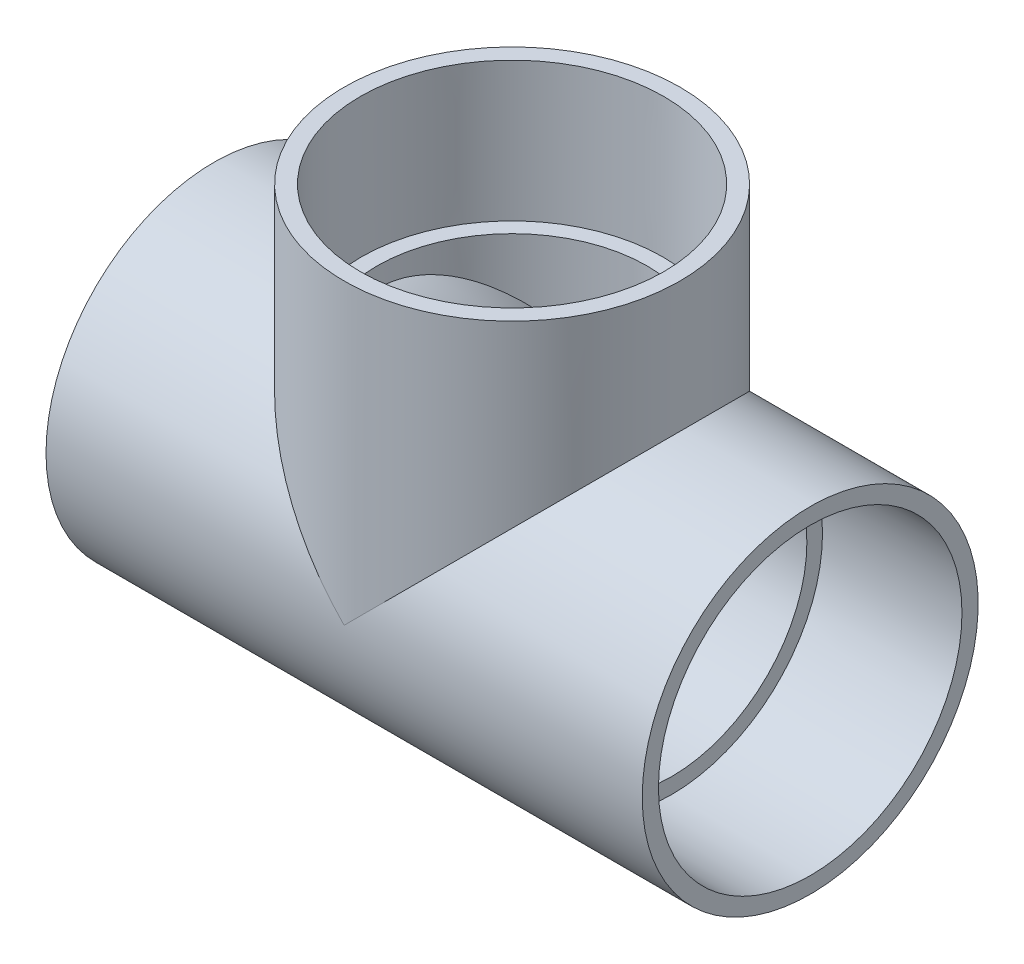
ISO-10303-21;
HEADER;
FILE_DESCRIPTION(('STEP AP214'),'2;1');
FILE_NAME('part.step','',(''),(''),'','','');
FILE_SCHEMA(('AUTOMOTIVE_DESIGN { 1 0 10303 214 1 1 1 1 }'));
ENDSEC;
DATA;
#1=APPLICATION_CONTEXT('core data for automotive mechanical design processes');
#2=APPLICATION_PROTOCOL_DEFINITION('international standard','automotive_design',2000,#1);
#3=PRODUCT_CONTEXT('',#1,'mechanical');
#4=PRODUCT('Part','Part','',(#3));
#5=PRODUCT_RELATED_PRODUCT_CATEGORY('part','',(#4));
#6=PRODUCT_DEFINITION_FORMATION('','',#4);
#7=PRODUCT_DEFINITION_CONTEXT('part definition',#1,'design');
#8=PRODUCT_DEFINITION('design','',#6,#7);
#9=PRODUCT_DEFINITION_SHAPE('','',#8);
#10=(LENGTH_UNIT() NAMED_UNIT(*) SI_UNIT(.MILLI.,.METRE.));
#11=(NAMED_UNIT(*) PLANE_ANGLE_UNIT() SI_UNIT($,.RADIAN.));
#12=(NAMED_UNIT(*) SI_UNIT($,.STERADIAN.) SOLID_ANGLE_UNIT());
#13=UNCERTAINTY_MEASURE_WITH_UNIT(LENGTH_MEASURE(1.E-05),#10,'distance_accuracy_value','');
#14=(GEOMETRIC_REPRESENTATION_CONTEXT(3) GLOBAL_UNCERTAINTY_ASSIGNED_CONTEXT((#13)) GLOBAL_UNIT_ASSIGNED_CONTEXT((#10,
#11,#12)) REPRESENTATION_CONTEXT('',''));
#15=CARTESIAN_POINT('',(0.,0.,0.));
#16=DIRECTION('',(0.,0.,1.));
#17=DIRECTION('',(1.,0.,0.));
#18=AXIS2_PLACEMENT_3D('',#15,#16,#17);
#19=CARTESIAN_POINT('',(-112.7125,0.,0.));
#20=DIRECTION('',(-1.,0.,0.));
#21=DIRECTION('',(0.,0.,1.));
#22=AXIS2_PLACEMENT_3D('',#19,#20,#21);
#23=CYLINDRICAL_SURFACE('',#22,63.5);
#24=CARTESIAN_POINT('',(-112.7125,0.,0.));
#25=DIRECTION('',(-1.,0.,0.));
#26=DIRECTION('',(0.,0.,1.));
#27=AXIS2_PLACEMENT_3D('',#24,#25,#26);
#28=CIRCLE('',#27,63.5);
#29=CARTESIAN_POINT('',(-112.7125,0.,63.5));
#30=VERTEX_POINT('',#29);
#31=EDGE_CURVE('E98',#30,#30,#28,.T.);
#32=ORIENTED_EDGE('',*,*,#31,.F.);
#33=EDGE_LOOP('',(#32));
#34=FACE_BOUND('',#33,.T.);
#35=CARTESIAN_POINT('',(112.7125,0.,0.));
#36=DIRECTION('',(-1.,0.,0.));
#37=DIRECTION('',(0.,0.,1.));
#38=AXIS2_PLACEMENT_3D('',#35,#36,#37);
#39=CIRCLE('',#38,63.5);
#40=CARTESIAN_POINT('',(112.7125,0.,63.5));
#41=VERTEX_POINT('',#40);
#42=EDGE_CURVE('E76',#41,#41,#39,.T.);
#43=ORIENTED_EDGE('',*,*,#42,.T.);
#44=EDGE_LOOP('',(#43));
#45=FACE_BOUND('',#44,.T.);
#46=CARTESIAN_POINT('',(0.,0.,0.));
#47=DIRECTION('',(-0.707106781186547,-0.707106781186547,0.));
#48=DIRECTION('',(-0.707106781186547,0.707106781186547,0.));
#49=AXIS2_PLACEMENT_3D('',#46,#47,#48);
#50=ELLIPSE('',#49,89.8025612106915,63.5);
#51=CARTESIAN_POINT('',(0.,0.,-63.5));
#52=VERTEX_POINT('',#51);
#53=CARTESIAN_POINT('',(0.,0.,63.5));
#54=VERTEX_POINT('',#53);
#55=EDGE_CURVE('E53',#52,#54,#50,.F.);
#56=ORIENTED_EDGE('',*,*,#55,.F.);
#57=CARTESIAN_POINT('',(0.,0.,0.));
#58=DIRECTION('',(0.707106781186547,-0.707106781186547,0.));
#59=DIRECTION('',(-0.707106781186547,-0.707106781186547,0.));
#60=AXIS2_PLACEMENT_3D('',#57,#58,#59);
#61=ELLIPSE('',#60,89.8025612106915,63.5);
#62=EDGE_CURVE('E89',#52,#54,#61,.T.);
#63=ORIENTED_EDGE('',*,*,#62,.T.);
#64=EDGE_LOOP('',(#56,#63));
#65=FACE_BOUND('',#64,.T.);
#66=ADVANCED_FACE('F34',(#34,#45,#65),#23,.T.);
#67=CARTESIAN_POINT('',(-112.7125,-63.5,0.));
#68=DIRECTION('',(-1.,0.,0.));
#69=DIRECTION('',(0.,0.,1.));
#70=AXIS2_PLACEMENT_3D('',#67,#68,#69);
#71=PLANE('',#70);
#72=ORIENTED_EDGE('',*,*,#31,.T.);
#73=EDGE_LOOP('',(#72));
#74=FACE_BOUND('',#73,.T.);
#75=CARTESIAN_POINT('',(-112.7125,0.,0.));
#76=DIRECTION('',(-1.,0.,0.));
#77=DIRECTION('',(0.,0.,1.));
#78=AXIS2_PLACEMENT_3D('',#75,#76,#77);
#79=CIRCLE('',#78,57.3786);
#80=CARTESIAN_POINT('',(-112.7125,0.,57.3786));
#81=VERTEX_POINT('',#80);
#82=EDGE_CURVE('E106',#81,#81,#79,.T.);
#83=ORIENTED_EDGE('',*,*,#82,.F.);
#84=EDGE_LOOP('',(#83));
#85=FACE_BOUND('',#84,.T.);
#86=ADVANCED_FACE('F36',(#74,#85),#71,.T.);
#87=CARTESIAN_POINT('',(-60.325,0.,0.));
#88=DIRECTION('',(-1.,0.,0.));
#89=DIRECTION('',(0.,0.,1.));
#90=AXIS2_PLACEMENT_3D('',#87,#88,#89);
#91=CONICAL_SURFACE('',#90,57.0357,0.00654536107227507);
#92=ORIENTED_EDGE('',*,*,#82,.T.);
#93=EDGE_LOOP('',(#92));
#94=FACE_BOUND('',#93,.T.);
#95=CARTESIAN_POINT('',(-60.325,0.,0.));
#96=DIRECTION('',(-1.,0.,0.));
#97=DIRECTION('',(0.,0.,1.));
#98=AXIS2_PLACEMENT_3D('',#95,#96,#97);
#99=CIRCLE('',#98,57.0357);
#100=CARTESIAN_POINT('',(-60.325,0.,57.0357));
#101=VERTEX_POINT('',#100);
#102=EDGE_CURVE('E103',#101,#101,#99,.T.);
#103=ORIENTED_EDGE('',*,*,#102,.F.);
#104=EDGE_LOOP('',(#103));
#105=FACE_BOUND('',#104,.T.);
#106=ADVANCED_FACE('F140',(#94,#105),#91,.F.);
#107=CARTESIAN_POINT('',(237.699267087985,60.325,-19.8278686449149));
#108=DIRECTION('',(0.,-1.,0.));
#109=DIRECTION('',(0.,0.,-1.));
#110=AXIS2_PLACEMENT_3D('',#107,#108,#109);
#111=PLANE('',#110);
#112=CARTESIAN_POINT('',(0.,60.325,0.));
#113=DIRECTION('',(0.,1.,0.));
#114=DIRECTION('',(0.,0.,1.));
#115=AXIS2_PLACEMENT_3D('',#112,#113,#114);
#116=CIRCLE('',#115,51.1302);
#117=CARTESIAN_POINT('',(0.,60.325,51.1302));
#118=VERTEX_POINT('',#117);
#119=EDGE_CURVE('E74',#118,#118,#116,.T.);
#120=ORIENTED_EDGE('',*,*,#119,.F.);
#121=EDGE_LOOP('',(#120));
#122=FACE_BOUND('',#121,.T.);
#123=CARTESIAN_POINT('',(0.,60.325,0.));
#124=DIRECTION('',(0.,-1.,0.));
#125=DIRECTION('',(0.,0.,-1.));
#126=AXIS2_PLACEMENT_3D('',#123,#124,#125);
#127=CIRCLE('',#126,57.0357);
#128=CARTESIAN_POINT('',(0.,60.325,-57.0357));
#129=VERTEX_POINT('',#128);
#130=EDGE_CURVE('E60',#129,#129,#127,.F.);
#131=ORIENTED_EDGE('',*,*,#130,.T.);
#132=EDGE_LOOP('',(#131));
#133=FACE_BOUND('',#132,.T.);
#134=ADVANCED_FACE('F112',(#122,#133),#111,.F.);
#135=CARTESIAN_POINT('',(-60.325,0.,0.));
#136=DIRECTION('',(1.,0.,0.));
#137=DIRECTION('',(0.,0.,-1.));
#138=AXIS2_PLACEMENT_3D('',#135,#136,#137);
#139=PLANE('',#138);
#140=CARTESIAN_POINT('',(-60.325,0.,0.));
#141=DIRECTION('',(-1.,0.,0.));
#142=DIRECTION('',(0.,0.,1.));
#143=AXIS2_PLACEMENT_3D('',#140,#141,#142);
#144=CIRCLE('',#143,51.1302);
#145=CARTESIAN_POINT('',(-60.325,0.,51.1302));
#146=VERTEX_POINT('',#145);
#147=EDGE_CURVE('E72',#146,#146,#144,.T.);
#148=ORIENTED_EDGE('',*,*,#147,.F.);
#149=EDGE_LOOP('',(#148));
#150=FACE_BOUND('',#149,.T.);
#151=ORIENTED_EDGE('',*,*,#102,.T.);
#152=EDGE_LOOP('',(#151));
#153=FACE_BOUND('',#152,.T.);
#154=ADVANCED_FACE('F125',(#150,#153),#139,.F.);
#155=CARTESIAN_POINT('',(63.5,112.7125,0.));
#156=DIRECTION('',(0.,1.,0.));
#157=DIRECTION('',(0.,0.,1.));
#158=AXIS2_PLACEMENT_3D('',#155,#156,#157);
#159=PLANE('',#158);
#160=CARTESIAN_POINT('',(0.,112.7125,0.));
#161=DIRECTION('',(0.,-1.,0.));
#162=DIRECTION('',(0.,0.,-1.));
#163=AXIS2_PLACEMENT_3D('',#160,#161,#162);
#164=CIRCLE('',#163,57.3786);
#165=CARTESIAN_POINT('',(0.,112.7125,-57.3786));
#166=VERTEX_POINT('',#165);
#167=EDGE_CURVE('E91',#166,#166,#164,.T.);
#168=ORIENTED_EDGE('',*,*,#167,.T.);
#169=EDGE_LOOP('',(#168));
#170=FACE_BOUND('',#169,.T.);
#171=CARTESIAN_POINT('',(0.,112.7125,0.));
#172=DIRECTION('',(0.,-1.,0.));
#173=DIRECTION('',(0.,0.,-1.));
#174=AXIS2_PLACEMENT_3D('',#171,#172,#173);
#175=CIRCLE('',#174,63.5);
#176=CARTESIAN_POINT('',(0.,112.7125,-63.5));
#177=VERTEX_POINT('',#176);
#178=EDGE_CURVE('E94',#177,#177,#175,.T.);
#179=ORIENTED_EDGE('',*,*,#178,.F.);
#180=EDGE_LOOP('',(#179));
#181=FACE_BOUND('',#180,.T.);
#182=ADVANCED_FACE('F122',(#170,#181),#159,.T.);
#183=CARTESIAN_POINT('',(0.,0.,0.));
#184=DIRECTION('',(0.,-1.,0.));
#185=DIRECTION('',(0.,0.,-1.));
#186=AXIS2_PLACEMENT_3D('',#183,#184,#185);
#187=CYLINDRICAL_SURFACE('',#186,63.5);
#188=ORIENTED_EDGE('',*,*,#62,.F.);
#189=ORIENTED_EDGE('',*,*,#55,.T.);
#190=EDGE_LOOP('',(#188,#189));
#191=FACE_BOUND('',#190,.T.);
#192=ORIENTED_EDGE('',*,*,#178,.T.);
#193=EDGE_LOOP('',(#192));
#194=FACE_BOUND('',#193,.T.);
#195=ADVANCED_FACE('F118',(#191,#194),#187,.T.);
#196=CARTESIAN_POINT('',(0.,112.7125,0.));
#197=DIRECTION('',(0.,1.,0.));
#198=DIRECTION('',(0.,0.,1.));
#199=AXIS2_PLACEMENT_3D('',#196,#197,#198);
#200=CONICAL_SURFACE('',#199,57.3786,0.00654536107227507);
#201=ORIENTED_EDGE('',*,*,#130,.F.);
#202=EDGE_LOOP('',(#201));
#203=FACE_BOUND('',#202,.T.);
#204=ORIENTED_EDGE('',*,*,#167,.F.);
#205=EDGE_LOOP('',(#204));
#206=FACE_BOUND('',#205,.T.);
#207=ADVANCED_FACE('F114',(#203,#206),#200,.F.);
#208=CARTESIAN_POINT('',(112.7125,-63.5,0.));
#209=DIRECTION('',(1.,0.,0.));
#210=DIRECTION('',(0.,0.,1.));
#211=AXIS2_PLACEMENT_3D('',#208,#209,#210);
#212=PLANE('',#211);
#213=ORIENTED_EDGE('',*,*,#42,.F.);
#214=EDGE_LOOP('',(#213));
#215=FACE_BOUND('',#214,.T.);
#216=CARTESIAN_POINT('',(112.7125,0.,0.));
#217=DIRECTION('',(-1.,0.,0.));
#218=DIRECTION('',(0.,0.,1.));
#219=AXIS2_PLACEMENT_3D('',#216,#217,#218);
#220=CIRCLE('',#219,57.3786);
#221=CARTESIAN_POINT('',(112.7125,0.,57.3786));
#222=VERTEX_POINT('',#221);
#223=EDGE_CURVE('E86',#222,#222,#220,.T.);
#224=ORIENTED_EDGE('',*,*,#223,.T.);
#225=EDGE_LOOP('',(#224));
#226=FACE_BOUND('',#225,.T.);
#227=ADVANCED_FACE('F117',(#215,#226),#212,.T.);
#228=CARTESIAN_POINT('',(60.325,0.,0.));
#229=DIRECTION('',(1.,0.,0.));
#230=DIRECTION('',(0.,0.,1.));
#231=AXIS2_PLACEMENT_3D('',#228,#229,#230);
#232=CONICAL_SURFACE('',#231,57.0357,0.00654536107227507);
#233=ORIENTED_EDGE('',*,*,#223,.F.);
#234=EDGE_LOOP('',(#233));
#235=FACE_BOUND('',#234,.T.);
#236=CARTESIAN_POINT('',(60.325,0.,0.));
#237=DIRECTION('',(-1.,0.,0.));
#238=DIRECTION('',(0.,0.,1.));
#239=AXIS2_PLACEMENT_3D('',#236,#237,#238);
#240=CIRCLE('',#239,57.0357);
#241=CARTESIAN_POINT('',(60.325,0.,57.0357));
#242=VERTEX_POINT('',#241);
#243=EDGE_CURVE('E83',#242,#242,#240,.T.);
#244=ORIENTED_EDGE('',*,*,#243,.T.);
#245=EDGE_LOOP('',(#244));
#246=FACE_BOUND('',#245,.T.);
#247=ADVANCED_FACE('F161',(#235,#246),#232,.F.);
#248=CARTESIAN_POINT('',(60.325,-63.5,0.));
#249=DIRECTION('',(-1.,0.,0.));
#250=DIRECTION('',(0.,0.,-1.));
#251=AXIS2_PLACEMENT_3D('',#248,#249,#250);
#252=PLANE('',#251);
#253=CARTESIAN_POINT('',(60.325,0.,0.));
#254=DIRECTION('',(-1.,0.,0.));
#255=DIRECTION('',(0.,0.,1.));
#256=AXIS2_PLACEMENT_3D('',#253,#254,#255);
#257=CIRCLE('',#256,51.1302);
#258=CARTESIAN_POINT('',(60.325,0.,51.1302));
#259=VERTEX_POINT('',#258);
#260=EDGE_CURVE('E69',#259,#259,#257,.F.);
#261=ORIENTED_EDGE('',*,*,#260,.F.);
#262=EDGE_LOOP('',(#261));
#263=FACE_BOUND('',#262,.T.);
#264=ORIENTED_EDGE('',*,*,#243,.F.);
#265=EDGE_LOOP('',(#264));
#266=FACE_BOUND('',#265,.T.);
#267=ADVANCED_FACE('F64',(#263,#266),#252,.F.);
#268=CARTESIAN_POINT('',(204.943044573698,0.,0.));
#269=DIRECTION('',(-1.,0.,0.));
#270=DIRECTION('',(0.,0.,1.));
#271=AXIS2_PLACEMENT_3D('',#268,#269,#270);
#272=CYLINDRICAL_SURFACE('',#271,51.1302);
#273=CARTESIAN_POINT('',(0.,0.,0.));
#274=DIRECTION('',(-0.707106781186548,-0.707106781186547,0.));
#275=DIRECTION('',(-0.707106781186548,0.707106781186547,0.));
#276=AXIS2_PLACEMENT_3D('',#273,#274,#275);
#277=ELLIPSE('',#276,72.3090222868488,51.1302);
#278=CARTESIAN_POINT('',(0.,0.,-51.1302));
#279=VERTEX_POINT('',#278);
#280=CARTESIAN_POINT('',(0.,0.,51.1302));
#281=VERTEX_POINT('',#280);
#282=EDGE_CURVE('E42',#279,#281,#277,.F.);
#283=ORIENTED_EDGE('',*,*,#282,.T.);
#284=CARTESIAN_POINT('',(0.,0.,0.));
#285=DIRECTION('',(-0.707106781186548,0.707106781186547,0.));
#286=DIRECTION('',(-0.707106781186548,-0.707106781186547,0.));
#287=AXIS2_PLACEMENT_3D('',#284,#285,#286);
#288=ELLIPSE('',#287,72.3090222868488,51.1302);
#289=EDGE_CURVE('E11',#281,#279,#288,.T.);
#290=ORIENTED_EDGE('',*,*,#289,.T.);
#291=EDGE_LOOP('',(#283,#290));
#292=FACE_BOUND('',#291,.T.);
#293=ORIENTED_EDGE('',*,*,#260,.T.);
#294=EDGE_LOOP('',(#293));
#295=FACE_BOUND('',#294,.T.);
#296=ORIENTED_EDGE('',*,*,#147,.T.);
#297=EDGE_LOOP('',(#296));
#298=FACE_BOUND('',#297,.T.);
#299=ADVANCED_FACE('F61',(#292,#295,#298),#272,.F.);
#300=CARTESIAN_POINT('',(0.,0.,0.));
#301=DIRECTION('',(0.,1.,0.));
#302=DIRECTION('',(0.,0.,1.));
#303=AXIS2_PLACEMENT_3D('',#300,#301,#302);
#304=CYLINDRICAL_SURFACE('',#303,51.1302);
#305=ORIENTED_EDGE('',*,*,#119,.T.);
#306=EDGE_LOOP('',(#305));
#307=FACE_BOUND('',#306,.T.);
#308=ORIENTED_EDGE('',*,*,#282,.F.);
#309=ORIENTED_EDGE('',*,*,#289,.F.);
#310=EDGE_LOOP('',(#308,#309));
#311=FACE_BOUND('',#310,.T.);
#312=ADVANCED_FACE('F58',(#307,#311),#304,.F.);
#313=CLOSED_SHELL('',(#66,#86,#106,#134,#154,#182,#195,#207,#227,#247,#267,#299,#312));
#314=MANIFOLD_SOLID_BREP('B2',#313);
#315=ADVANCED_BREP_SHAPE_REPRESENTATION('',(#18,#314),#14);
#316=SHAPE_DEFINITION_REPRESENTATION(#9,#315);
ENDSEC;
END-ISO-10303-21;
